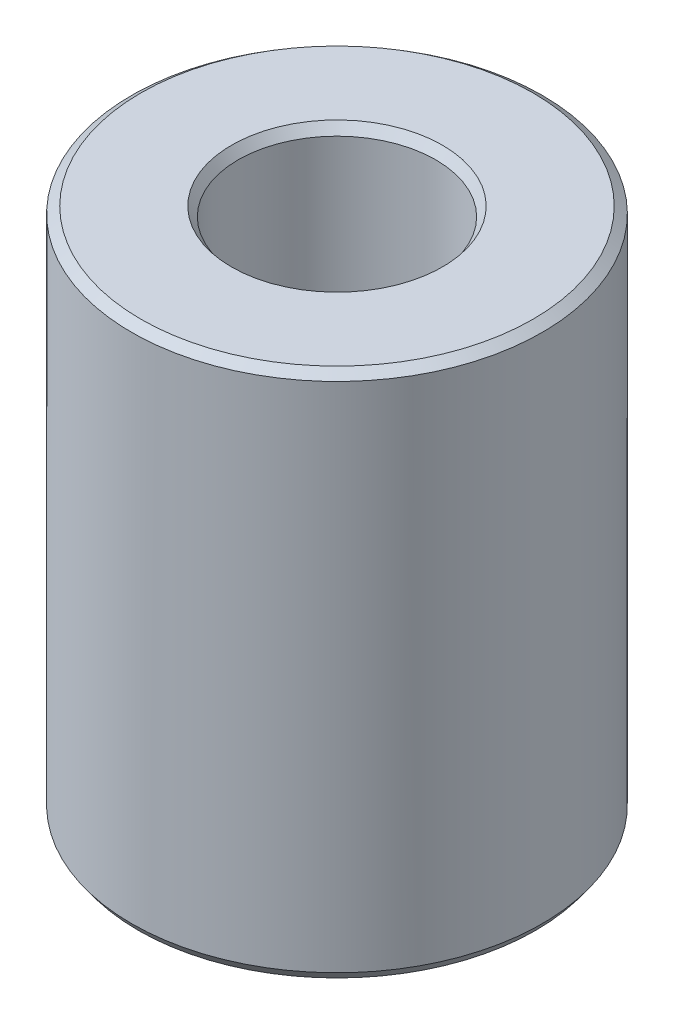
ISO-10303-21;
HEADER;
FILE_DESCRIPTION(('STEP AP214'),'2;1');
FILE_NAME('part.step','',(''),(''),'','','');
FILE_SCHEMA(('AUTOMOTIVE_DESIGN { 1 0 10303 214 1 1 1 1 }'));
ENDSEC;
DATA;
#1=APPLICATION_CONTEXT('core data for automotive mechanical design processes');
#2=APPLICATION_PROTOCOL_DEFINITION('international standard','automotive_design',2000,#1);
#3=PRODUCT_CONTEXT('',#1,'mechanical');
#4=PRODUCT('Part','Part','',(#3));
#5=PRODUCT_RELATED_PRODUCT_CATEGORY('part','',(#4));
#6=PRODUCT_DEFINITION_FORMATION('','',#4);
#7=PRODUCT_DEFINITION_CONTEXT('part definition',#1,'design');
#8=PRODUCT_DEFINITION('design','',#6,#7);
#9=PRODUCT_DEFINITION_SHAPE('','',#8);
#10=(LENGTH_UNIT() NAMED_UNIT(*) SI_UNIT(.MILLI.,.METRE.));
#11=(NAMED_UNIT(*) PLANE_ANGLE_UNIT() SI_UNIT($,.RADIAN.));
#12=(NAMED_UNIT(*) SI_UNIT($,.STERADIAN.) SOLID_ANGLE_UNIT());
#13=UNCERTAINTY_MEASURE_WITH_UNIT(LENGTH_MEASURE(1.E-05),#10,'distance_accuracy_value','');
#14=(GEOMETRIC_REPRESENTATION_CONTEXT(3) GLOBAL_UNCERTAINTY_ASSIGNED_CONTEXT((#13)) GLOBAL_UNIT_ASSIGNED_CONTEXT((#10,
#11,#12)) REPRESENTATION_CONTEXT('',''));
#15=CARTESIAN_POINT('',(0.,0.,0.));
#16=DIRECTION('',(0.,0.,1.));
#17=DIRECTION('',(1.,0.,0.));
#18=AXIS2_PLACEMENT_3D('',#15,#16,#17);
#19=CARTESIAN_POINT('',(0.,25.7189600427996,0.));
#20=DIRECTION('',(0.,-1.,0.));
#21=DIRECTION('',(0.,0.,-1.));
#22=AXIS2_PLACEMENT_3D('',#19,#20,#21);
#23=CYLINDRICAL_SURFACE('',#22,10.);
#24=CARTESIAN_POINT('',(0.,0.451935567559361,0.));
#25=DIRECTION('',(0.,1.,0.));
#26=DIRECTION('',(0.,0.,1.));
#27=AXIS2_PLACEMENT_3D('',#24,#25,#26);
#28=CIRCLE('',#27,10.);
#29=CARTESIAN_POINT('',(0.,0.451935567559358,-10.));
#30=VERTEX_POINT('',#29);
#31=EDGE_CURVE('E10',#30,#30,#28,.T.);
#32=CARTESIAN_POINT('',(0.,25.3911487817267,0.));
#33=DIRECTION('',(0.,1.,0.));
#34=DIRECTION('',(0.,0.,1.));
#35=AXIS2_PLACEMENT_3D('',#32,#33,#34);
#36=CIRCLE('',#35,10.);
#37=CARTESIAN_POINT('',(0.,25.3911487817267,-10.));
#38=VERTEX_POINT('',#37);
#39=EDGE_CURVE('E50',#38,#38,#36,.F.);
#40=CARTESIAN_POINT('',(0.,0.451935567559358,-10.));
#41=CARTESIAN_POINT('',(0.,0.711719038540267,-10.));
#42=CARTESIAN_POINT('',(0.,0.971502509521178,-10.));
#43=CARTESIAN_POINT('',(0.,1.491069451483,-10.));
#44=CARTESIAN_POINT('',(0.,1.75085292246391,-10.));
#45=CARTESIAN_POINT('',(0.,2.27041986442572,-10.));
#46=CARTESIAN_POINT('',(0.,2.53020333540663,-10.));
#47=CARTESIAN_POINT('',(0.,3.04977027736845,-10.));
#48=CARTESIAN_POINT('',(0.,3.30955374834936,-10.));
#49=CARTESIAN_POINT('',(0.,3.82912069031118,-10.));
#50=CARTESIAN_POINT('',(0.,4.08890416129209,-10.));
#51=CARTESIAN_POINT('',(0.,4.60847110325391,-10.));
#52=CARTESIAN_POINT('',(0.,4.86825457423482,-10.));
#53=CARTESIAN_POINT('',(0.,5.38782151619664,-10.));
#54=CARTESIAN_POINT('',(0.,5.64760498717755,-10.));
#55=CARTESIAN_POINT('',(0.,6.16717192913937,-10.));
#56=CARTESIAN_POINT('',(0.,6.42695540012028,-10.));
#57=CARTESIAN_POINT('',(0.,6.9465223420821,-10.));
#58=CARTESIAN_POINT('',(0.,7.20630581306301,-10.));
#59=CARTESIAN_POINT('',(0.,7.72587275502483,-10.));
#60=CARTESIAN_POINT('',(0.,7.98565622600574,-10.));
#61=CARTESIAN_POINT('',(0.,8.50522316796756,-10.));
#62=CARTESIAN_POINT('',(0.,8.76500663894847,-10.));
#63=CARTESIAN_POINT('',(0.,9.28457358091029,-10.));
#64=CARTESIAN_POINT('',(0.,9.5443570518912,-10.));
#65=CARTESIAN_POINT('',(0.,10.063923993853,-10.));
#66=CARTESIAN_POINT('',(0.,10.3237074648339,-10.));
#67=CARTESIAN_POINT('',(0.,10.8432744067957,-10.));
#68=CARTESIAN_POINT('',(0.,11.1030578777767,-10.));
#69=CARTESIAN_POINT('',(0.,11.6226248197385,-10.));
#70=CARTESIAN_POINT('',(0.,11.8824082907194,-10.));
#71=CARTESIAN_POINT('',(0.,12.4019752326812,-10.));
#72=CARTESIAN_POINT('',(0.,12.6617587036621,-10.));
#73=CARTESIAN_POINT('',(0.,13.1813256456239,-10.));
#74=CARTESIAN_POINT('',(0.,13.4411091166048,-10.));
#75=CARTESIAN_POINT('',(0.,13.9606760585667,-10.));
#76=CARTESIAN_POINT('',(0.,14.2204595295476,-10.));
#77=CARTESIAN_POINT('',(0.,14.7400264715094,-10.));
#78=CARTESIAN_POINT('',(0.,14.9998099424903,-10.));
#79=CARTESIAN_POINT('',(0.,15.5193768844521,-10.));
#80=CARTESIAN_POINT('',(0.,15.779160355433,-10.));
#81=CARTESIAN_POINT('',(0.,16.2987272973948,-10.));
#82=CARTESIAN_POINT('',(0.,16.5585107683758,-10.));
#83=CARTESIAN_POINT('',(0.,17.0780777103376,-10.));
#84=CARTESIAN_POINT('',(0.,17.3378611813185,-10.));
#85=CARTESIAN_POINT('',(0.,17.8574281232803,-10.));
#86=CARTESIAN_POINT('',(0.,18.1172115942612,-10.));
#87=CARTESIAN_POINT('',(0.,18.636778536223,-10.));
#88=CARTESIAN_POINT('',(0.,18.8965620072039,-10.));
#89=CARTESIAN_POINT('',(0.,19.4161289491658,-10.));
#90=CARTESIAN_POINT('',(0.,19.6759124201467,-10.));
#91=CARTESIAN_POINT('',(0.,20.1954793621085,-10.));
#92=CARTESIAN_POINT('',(0.,20.4552628330894,-10.));
#93=CARTESIAN_POINT('',(0.,20.9748297750512,-10.));
#94=CARTESIAN_POINT('',(0.,21.2346132460321,-10.));
#95=CARTESIAN_POINT('',(0.,21.7541801879939,-10.));
#96=CARTESIAN_POINT('',(0.,22.0139636589749,-10.));
#97=CARTESIAN_POINT('',(0.,22.5335306009367,-10.));
#98=CARTESIAN_POINT('',(0.,22.7933140719176,-10.));
#99=CARTESIAN_POINT('',(0.,23.3128810138794,-10.));
#100=CARTESIAN_POINT('',(0.,23.5726644848603,-10.));
#101=CARTESIAN_POINT('',(0.,24.0922314268221,-10.));
#102=CARTESIAN_POINT('',(0.,24.352014897803,-10.));
#103=CARTESIAN_POINT('',(0.,24.8715818397649,-10.));
#104=CARTESIAN_POINT('',(0.,25.1313653107458,-10.));
#105=CARTESIAN_POINT('',(0.,25.3911487817267,-10.));
#106=B_SPLINE_CURVE_WITH_KNOTS('',3,(#40,#41,#42,#43,#44,#45,#46,#47,#48,#49,#50,#51,#52,#53,
#54,#55,#56,#57,#58,#59,#60,#61,#62,#63,#64,#65,#66,#67,#68,#69,#70,#71,#72,#73,#74,#75,#76,#77,
#78,#79,#80,#81,#82,#83,#84,#85,#86,#87,#88,#89,#90,#91,#92,#93,#94,#95,#96,#97,#98,#99,#100,
#101,#102,#103,#104,#105),.UNSPECIFIED.,.F.,.F.,(4,2,2,2,2,2,2,2,2,2,2,2,2,2,2,2,2,2,2,2,2,2,2,
2,2,2,2,2,2,2,2,2,4),(0.,0.77935041294273,1.55870082588546,2.33805123882819,3.11740165177092,
3.89675206471364,4.67610247765637,5.4554528905991,6.23480330354183,7.01415371648456,
7.79350412942729,8.57285454237002,9.35220495531275,10.1315553682555,10.9109057811982,
11.6902561941409,12.4696066070837,13.2489570200264,14.0283074329691,14.8076578459118,
15.5870082588546,16.3663586717973,17.14570908474,17.9250594976828,18.7044099106255,
19.4837603235682,20.2631107365109,21.0424611494537,21.8218115623964,22.6011619753391,
23.3805123882819,24.1598628012246,24.9392132141673),.UNSPECIFIED.);
#107=EDGE_CURVE('BSEAM39',#30,#38,#106,.T.);
#108=ORIENTED_EDGE('',*,*,#31,.T.);
#109=ORIENTED_EDGE('',*,*,#39,.T.);
#110=ORIENTED_EDGE('',*,*,#107,.T.);
#111=ORIENTED_EDGE('',*,*,#107,.F.);
#112=EDGE_LOOP('',(#108,#110,#109,#111));
#113=FACE_BOUND('',#112,.T.);
#114=ADVANCED_FACE('F39',(#113),#23,.T.);
#115=CARTESIAN_POINT('',(0.,25.7189600427996,0.));
#116=DIRECTION('',(0.,1.,0.));
#117=DIRECTION('',(0.,0.,1.));
#118=AXIS2_PLACEMENT_3D('',#115,#116,#117);
#119=PLANE('',#118);
#120=CARTESIAN_POINT('',(0.,25.7189600427996,0.));
#121=DIRECTION('',(0.,1.,0.));
#122=DIRECTION('',(0.,0.,1.));
#123=AXIS2_PLACEMENT_3D('',#120,#121,#122);
#124=CIRCLE('',#123,5.13809016415094);
#125=CARTESIAN_POINT('',(0.,25.7189600427996,5.13809016415094));
#126=VERTEX_POINT('',#125);
#127=EDGE_CURVE('E58',#126,#126,#124,.F.);
#128=ORIENTED_EDGE('',*,*,#127,.T.);
#129=EDGE_LOOP('',(#128));
#130=FACE_BOUND('',#129,.T.);
#131=CARTESIAN_POINT('',(0.,25.7189600427996,0.));
#132=DIRECTION('',(0.,1.,0.));
#133=DIRECTION('',(0.,0.,1.));
#134=AXIS2_PLACEMENT_3D('',#131,#132,#133);
#135=CIRCLE('',#134,9.54806443244068);
#136=CARTESIAN_POINT('',(0.,25.7189600427996,9.54806443244068));
#137=VERTEX_POINT('',#136);
#138=EDGE_CURVE('E61',#137,#137,#135,.T.);
#139=ORIENTED_EDGE('',*,*,#138,.T.);
#140=EDGE_LOOP('',(#139));
#141=FACE_BOUND('',#140,.T.);
#142=ADVANCED_FACE('F88',(#130,#141),#119,.T.);
#143=CARTESIAN_POINT('',(0.,0.,0.));
#144=DIRECTION('',(0.,1.,0.));
#145=DIRECTION('',(0.,0.,1.));
#146=AXIS2_PLACEMENT_3D('',#143,#144,#145);
#147=PLANE('',#146);
#148=CARTESIAN_POINT('',(0.,0.,0.));
#149=DIRECTION('',(0.,1.,0.));
#150=DIRECTION('',(0.,0.,1.));
#151=AXIS2_PLACEMENT_3D('',#148,#149,#150);
#152=CIRCLE('',#151,5.26221447063731);
#153=CARTESIAN_POINT('',(0.,0.,5.26221447063731));
#154=VERTEX_POINT('',#153);
#155=EDGE_CURVE('E51',#154,#154,#152,.T.);
#156=ORIENTED_EDGE('',*,*,#155,.T.);
#157=EDGE_LOOP('',(#156));
#158=FACE_BOUND('',#157,.T.);
#159=CARTESIAN_POINT('',(0.,0.,0.));
#160=DIRECTION('',(0.,1.,0.));
#161=DIRECTION('',(0.,0.,1.));
#162=AXIS2_PLACEMENT_3D('',#159,#160,#161);
#163=CIRCLE('',#162,9.67218873892703);
#164=CARTESIAN_POINT('',(0.,0.,9.67218873892703));
#165=VERTEX_POINT('',#164);
#166=EDGE_CURVE('E54',#165,#165,#163,.F.);
#167=ORIENTED_EDGE('',*,*,#166,.T.);
#168=EDGE_LOOP('',(#167));
#169=FACE_BOUND('',#168,.T.);
#170=ADVANCED_FACE('F83',(#158,#169),#147,.F.);
#171=CARTESIAN_POINT('',(0.,25.7189600427996,0.));
#172=DIRECTION('',(0.,-1.,0.));
#173=DIRECTION('',(0.,0.,-1.));
#174=AXIS2_PLACEMENT_3D('',#171,#172,#173);
#175=CYLINDRICAL_SURFACE('',#174,4.81027890307798);
#176=CARTESIAN_POINT('',(0.,25.2670244752403,0.));
#177=DIRECTION('',(0.,1.,0.));
#178=DIRECTION('',(0.,0.,1.));
#179=AXIS2_PLACEMENT_3D('',#176,#177,#178);
#180=CIRCLE('',#179,4.81027890307798);
#181=CARTESIAN_POINT('',(0.,25.2670244752403,-4.81027890307798));
#182=VERTEX_POINT('',#181);
#183=EDGE_CURVE('E67',#182,#182,#180,.T.);
#184=CARTESIAN_POINT('',(0.,0.327811261072949,0.));
#185=DIRECTION('',(0.,1.,0.));
#186=DIRECTION('',(0.,0.,1.));
#187=AXIS2_PLACEMENT_3D('',#184,#185,#186);
#188=CIRCLE('',#187,4.81027890307798);
#189=CARTESIAN_POINT('',(0.,0.327811261072949,-4.81027890307798));
#190=VERTEX_POINT('',#189);
#191=EDGE_CURVE('E69',#190,#190,#188,.F.);
#192=CARTESIAN_POINT('',(0.,25.2670244752403,-4.81027890307798));
#193=CARTESIAN_POINT('',(0.,25.0072410042594,-4.81027890307798));
#194=CARTESIAN_POINT('',(0.,24.7474575332785,-4.81027890307798));
#195=CARTESIAN_POINT('',(0.,24.2278905913166,-4.81027890307798));
#196=CARTESIAN_POINT('',(0.,23.9681071203357,-4.81027890307798));
#197=CARTESIAN_POINT('',(0.,23.4485401783739,-4.81027890307798));
#198=CARTESIAN_POINT('',(0.,23.188756707393,-4.81027890307798));
#199=CARTESIAN_POINT('',(0.,22.6691897654312,-4.81027890307798));
#200=CARTESIAN_POINT('',(0.,22.4094062944503,-4.81027890307798));
#201=CARTESIAN_POINT('',(0.,21.8898393524885,-4.81027890307798));
#202=CARTESIAN_POINT('',(0.,21.6300558815075,-4.81027890307798));
#203=CARTESIAN_POINT('',(0.,21.1104889395457,-4.81027890307798));
#204=CARTESIAN_POINT('',(0.,20.8507054685648,-4.81027890307798));
#205=CARTESIAN_POINT('',(0.,20.331138526603,-4.81027890307798));
#206=CARTESIAN_POINT('',(0.,20.0713550556221,-4.81027890307798));
#207=CARTESIAN_POINT('',(0.,19.5517881136603,-4.81027890307798));
#208=CARTESIAN_POINT('',(0.,19.2920046426794,-4.81027890307798));
#209=CARTESIAN_POINT('',(0.,18.7724377007175,-4.81027890307798));
#210=CARTESIAN_POINT('',(0.,18.5126542297366,-4.81027890307798));
#211=CARTESIAN_POINT('',(0.,17.9930872877748,-4.81027890307798));
#212=CARTESIAN_POINT('',(0.,17.7333038167939,-4.81027890307798));
#213=CARTESIAN_POINT('',(0.,17.2137368748321,-4.81027890307798));
#214=CARTESIAN_POINT('',(0.,16.9539534038512,-4.81027890307798));
#215=CARTESIAN_POINT('',(0.,16.4343864618894,-4.81027890307798));
#216=CARTESIAN_POINT('',(0.,16.1746029909084,-4.81027890307798));
#217=CARTESIAN_POINT('',(0.,15.6550360489466,-4.81027890307798));
#218=CARTESIAN_POINT('',(0.,15.3952525779657,-4.81027890307798));
#219=CARTESIAN_POINT('',(0.,14.8756856360039,-4.81027890307798));
#220=CARTESIAN_POINT('',(0.,14.615902165023,-4.81027890307798));
#221=CARTESIAN_POINT('',(0.,14.0963352230612,-4.81027890307798));
#222=CARTESIAN_POINT('',(0.,13.8365517520803,-4.81027890307798));
#223=CARTESIAN_POINT('',(0.,13.3169848101184,-4.81027890307798));
#224=CARTESIAN_POINT('',(0.,13.0572013391375,-4.81027890307798));
#225=CARTESIAN_POINT('',(0.,12.5376343971757,-4.81027890307798));
#226=CARTESIAN_POINT('',(0.,12.2778509261948,-4.81027890307798));
#227=CARTESIAN_POINT('',(0.,11.758283984233,-4.81027890307798));
#228=CARTESIAN_POINT('',(0.,11.4985005132521,-4.81027890307798));
#229=CARTESIAN_POINT('',(0.,10.9789335712902,-4.81027890307798));
#230=CARTESIAN_POINT('',(0.,10.7191501003093,-4.81027890307798));
#231=CARTESIAN_POINT('',(0.,10.1995831583475,-4.81027890307798));
#232=CARTESIAN_POINT('',(0.,9.93979968736661,-4.81027890307798));
#233=CARTESIAN_POINT('',(0.,9.42023274540479,-4.81027890307798));
#234=CARTESIAN_POINT('',(0.,9.16044927442388,-4.81027890307798));
#235=CARTESIAN_POINT('',(0.,8.64088233246206,-4.81027890307798));
#236=CARTESIAN_POINT('',(0.,8.38109886148115,-4.81027890307798));
#237=CARTESIAN_POINT('',(0.,7.86153191951933,-4.81027890307798));
#238=CARTESIAN_POINT('',(0.,7.60174844853842,-4.81027890307798));
#239=CARTESIAN_POINT('',(0.,7.0821815065766,-4.81027890307798));
#240=CARTESIAN_POINT('',(0.,6.82239803559569,-4.81027890307798));
#241=CARTESIAN_POINT('',(0.,6.30283109363387,-4.81027890307798));
#242=CARTESIAN_POINT('',(0.,6.04304762265297,-4.81027890307798));
#243=CARTESIAN_POINT('',(0.,5.52348068069115,-4.81027890307798));
#244=CARTESIAN_POINT('',(0.,5.26369720971023,-4.81027890307798));
#245=CARTESIAN_POINT('',(0.,4.74413026774841,-4.81027890307798));
#246=CARTESIAN_POINT('',(0.,4.48434679676751,-4.81027890307798));
#247=CARTESIAN_POINT('',(0.,3.96477985480569,-4.81027890307798));
#248=CARTESIAN_POINT('',(0.,3.70499638382478,-4.81027890307798));
#249=CARTESIAN_POINT('',(0.,3.18542944186296,-4.81027890307798));
#250=CARTESIAN_POINT('',(0.,2.92564597088205,-4.81027890307798));
#251=CARTESIAN_POINT('',(0.,2.40607902892023,-4.81027890307798));
#252=CARTESIAN_POINT('',(0.,2.14629555793932,-4.81027890307798));
#253=CARTESIAN_POINT('',(0.,1.6267286159775,-4.81027890307798));
#254=CARTESIAN_POINT('',(0.,1.36694514499659,-4.81027890307798));
#255=CARTESIAN_POINT('',(0.,0.847378203034771,-4.81027890307798));
#256=CARTESIAN_POINT('',(0.,0.58759473205386,-4.81027890307798));
#257=CARTESIAN_POINT('',(0.,0.327811261072949,-4.81027890307798));
#258=B_SPLINE_CURVE_WITH_KNOTS('',3,(#192,#193,#194,#195,#196,#197,#198,#199,#200,#201,#202,
#203,#204,#205,#206,#207,#208,#209,#210,#211,#212,#213,#214,#215,#216,#217,#218,#219,#220,#221,
#222,#223,#224,#225,#226,#227,#228,#229,#230,#231,#232,#233,#234,#235,#236,#237,#238,#239,#240,
#241,#242,#243,#244,#245,#246,#247,#248,#249,#250,#251,#252,#253,#254,#255,#256,#257),
.UNSPECIFIED.,.F.,.F.,(4,2,2,2,2,2,2,2,2,2,2,2,2,2,2,2,2,2,2,2,2,2,2,2,2,2,2,2,2,2,2,2,4),(0.,
0.77935041294273,1.55870082588546,2.33805123882819,3.11740165177092,3.89675206471365,
4.67610247765637,5.4554528905991,6.23480330354183,7.01415371648456,7.79350412942729,
8.57285454237002,9.35220495531275,10.1315553682555,10.9109057811982,11.6902561941409,
12.4696066070837,13.2489570200264,14.0283074329691,14.8076578459119,15.5870082588546,
16.3663586717973,17.14570908474,17.9250594976828,18.7044099106255,19.4837603235682,
20.263110736511,21.0424611494537,21.8218115623964,22.6011619753391,23.3805123882819,
24.1598628012246,24.9392132141673),.UNSPECIFIED.);
#259=EDGE_CURVE('BSEAM71',#182,#190,#258,.T.);
#260=ORIENTED_EDGE('',*,*,#183,.T.);
#261=ORIENTED_EDGE('',*,*,#191,.T.);
#262=ORIENTED_EDGE('',*,*,#259,.T.);
#263=ORIENTED_EDGE('',*,*,#259,.F.);
#264=EDGE_LOOP('',(#260,#262,#261,#263));
#265=FACE_BOUND('',#264,.T.);
#266=ADVANCED_FACE('F71',(#265),#175,.F.);
#267=CARTESIAN_POINT('',(0.,25.2670244752403,0.));
#268=DIRECTION('',(0.,1.,0.));
#269=DIRECTION('',(0.,0.,1.));
#270=AXIS2_PLACEMENT_3D('',#267,#268,#269);
#271=CONICAL_SURFACE('',#270,4.81027890307798,0.62753727417858);
#272=ORIENTED_EDGE('',*,*,#127,.F.);
#273=EDGE_LOOP('',(#272));
#274=FACE_BOUND('',#273,.T.);
#275=ORIENTED_EDGE('',*,*,#183,.F.);
#276=EDGE_LOOP('',(#275));
#277=FACE_BOUND('',#276,.T.);
#278=ADVANCED_FACE('F77',(#274,#277),#271,.F.);
#279=CARTESIAN_POINT('',(0.,0.,0.));
#280=DIRECTION('',(0.,-1.,0.));
#281=DIRECTION('',(0.,0.,-1.));
#282=AXIS2_PLACEMENT_3D('',#279,#280,#281);
#283=CONICAL_SURFACE('',#282,5.26221447063731,0.943259052616315);
#284=ORIENTED_EDGE('',*,*,#191,.F.);
#285=EDGE_LOOP('',(#284));
#286=FACE_BOUND('',#285,.T.);
#287=ORIENTED_EDGE('',*,*,#155,.F.);
#288=EDGE_LOOP('',(#287));
#289=FACE_BOUND('',#288,.T.);
#290=ADVANCED_FACE('F73',(#286,#289),#283,.F.);
#291=CARTESIAN_POINT('',(0.,0.451935567559361,0.));
#292=DIRECTION('',(0.,1.,0.));
#293=DIRECTION('',(0.,0.,1.));
#294=AXIS2_PLACEMENT_3D('',#291,#292,#293);
#295=CONICAL_SURFACE('',#294,10.,0.627537274178582);
#296=ORIENTED_EDGE('',*,*,#166,.F.);
#297=EDGE_LOOP('',(#296));
#298=FACE_BOUND('',#297,.T.);
#299=ORIENTED_EDGE('',*,*,#31,.F.);
#300=EDGE_LOOP('',(#299));
#301=FACE_BOUND('',#300,.T.);
#302=ADVANCED_FACE('F76',(#298,#301),#295,.T.);
#303=CARTESIAN_POINT('',(0.,25.7189600427996,0.));
#304=DIRECTION('',(0.,-1.,0.));
#305=DIRECTION('',(0.,0.,-1.));
#306=AXIS2_PLACEMENT_3D('',#303,#304,#305);
#307=CONICAL_SURFACE('',#306,9.54806443244068,0.943259052616311);
#308=ORIENTED_EDGE('',*,*,#39,.F.);
#309=EDGE_LOOP('',(#308));
#310=FACE_BOUND('',#309,.T.);
#311=ORIENTED_EDGE('',*,*,#138,.F.);
#312=EDGE_LOOP('',(#311));
#313=FACE_BOUND('',#312,.T.);
#314=ADVANCED_FACE('F45',(#310,#313),#307,.T.);
#315=CLOSED_SHELL('',(#114,#142,#170,#266,#278,#290,#302,#314));
#316=MANIFOLD_SOLID_BREP('B2',#315);
#317=ADVANCED_BREP_SHAPE_REPRESENTATION('',(#18,#316),#14);
#318=SHAPE_DEFINITION_REPRESENTATION(#9,#317);
ENDSEC;
END-ISO-10303-21;
